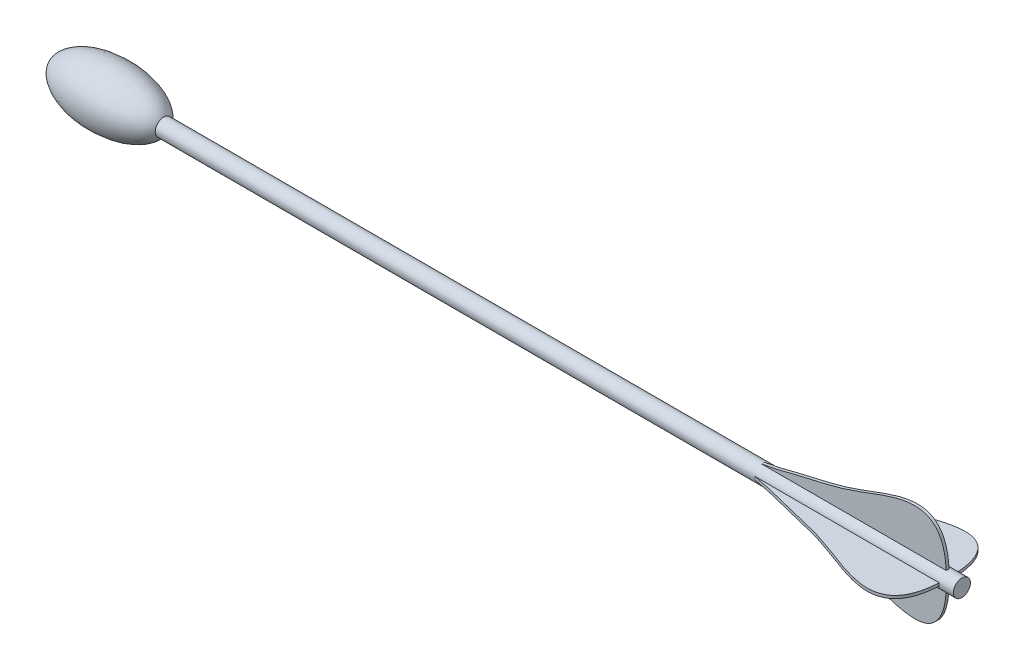
ISO-10303-21;
HEADER;
FILE_DESCRIPTION(('STEP AP214'),'2;1');
FILE_NAME('part.step','',(''),(''),'','','');
FILE_SCHEMA(('AUTOMOTIVE_DESIGN { 1 0 10303 214 1 1 1 1 }'));
ENDSEC;
DATA;
#1=APPLICATION_CONTEXT('core data for automotive mechanical design processes');
#2=APPLICATION_PROTOCOL_DEFINITION('international standard','automotive_design',2000,#1);
#3=PRODUCT_CONTEXT('',#1,'mechanical');
#4=PRODUCT('Part','Part','',(#3));
#5=PRODUCT_RELATED_PRODUCT_CATEGORY('part','',(#4));
#6=PRODUCT_DEFINITION_FORMATION('','',#4);
#7=PRODUCT_DEFINITION_CONTEXT('part definition',#1,'design');
#8=PRODUCT_DEFINITION('design','',#6,#7);
#9=PRODUCT_DEFINITION_SHAPE('','',#8);
#10=(LENGTH_UNIT() NAMED_UNIT(*) SI_UNIT(.MILLI.,.METRE.));
#11=(NAMED_UNIT(*) PLANE_ANGLE_UNIT() SI_UNIT($,.RADIAN.));
#12=(NAMED_UNIT(*) SI_UNIT($,.STERADIAN.) SOLID_ANGLE_UNIT());
#13=UNCERTAINTY_MEASURE_WITH_UNIT(LENGTH_MEASURE(1.E-05),#10,'distance_accuracy_value','');
#14=(GEOMETRIC_REPRESENTATION_CONTEXT(3) GLOBAL_UNCERTAINTY_ASSIGNED_CONTEXT((#13)) GLOBAL_UNIT_ASSIGNED_CONTEXT((#10,
#11,#12)) REPRESENTATION_CONTEXT('',''));
#15=CARTESIAN_POINT('',(0.,0.,0.));
#16=DIRECTION('',(0.,0.,1.));
#17=DIRECTION('',(1.,0.,0.));
#18=AXIS2_PLACEMENT_3D('',#15,#16,#17);
#19=CARTESIAN_POINT('',(590.,6.00000000000001,-0.999999999999979));
#20=CARTESIAN_POINT('',(585.929324234077,77.9307893094326,-0.999999999999728));
#21=CARTESIAN_POINT('',(513.784202435339,-0.952711564096372,-1.));
#22=CARTESIAN_POINT('',(520.965779305184,22.6473985539355,-0.999999999999921));
#23=CARTESIAN_POINT('',(489.80811324235,15.3745600280329,-0.999999999999946));
#24=CARTESIAN_POINT('',(487.391941510258,10.4812503897079,-0.999999999999963));
#25=CARTESIAN_POINT('',(460.,6.,-0.999999999999979));
#26=B_SPLINE_CURVE_WITH_KNOTS('',6,(#19,#20,#21,#22,#23,#24,#25),.UNSPECIFIED.,.F.,.F.,(7,7),
(0.,1.),.UNSPECIFIED.);
#27=DIRECTION('',(0.,0.,1.));
#28=VECTOR('',#27,1.);
#29=SURFACE_OF_LINEAR_EXTRUSION('',#26,#28);
#30=DIRECTION('',(0.,0.,1.));
#31=VECTOR('',#30,1.);
#32=CARTESIAN_POINT('',(460.,6.,-0.999999999999979));
#33=LINE('',#32,#31);
#34=CARTESIAN_POINT('',(460.,6.,-0.999999999999979));
#35=VERTEX_POINT('',#34);
#36=CARTESIAN_POINT('',(460.,6.,1.00000000000002));
#37=VERTEX_POINT('',#36);
#38=EDGE_CURVE('E47',#35,#37,#33,.T.);
#39=ORIENTED_EDGE('',*,*,#38,.T.);
#40=CARTESIAN_POINT('',(590.,6.,1.00000000000002));
#41=CARTESIAN_POINT('',(585.929324234077,77.9307893094326,1.00000000000027));
#42=CARTESIAN_POINT('',(513.784202435339,-0.952711564096379,0.999999999999997));
#43=CARTESIAN_POINT('',(520.965779305184,22.6473985539354,1.00000000000008));
#44=CARTESIAN_POINT('',(489.80811324235,15.3745600280329,1.00000000000005));
#45=CARTESIAN_POINT('',(487.391941510258,10.4812503897079,1.00000000000004));
#46=CARTESIAN_POINT('',(460.,6.,1.00000000000002));
#47=B_SPLINE_CURVE_WITH_KNOTS('',6,(#40,#41,#42,#43,#44,#45,#46),.UNSPECIFIED.,.F.,.F.,(7,7),
(0.,1.),.UNSPECIFIED.);
#48=CARTESIAN_POINT('',(590.,6.,1.00000000000002));
#49=VERTEX_POINT('',#48);
#50=EDGE_CURVE('E68',#49,#37,#47,.T.);
#51=ORIENTED_EDGE('',*,*,#50,.F.);
#52=DIRECTION('',(0.,0.,1.));
#53=VECTOR('',#52,1.);
#54=CARTESIAN_POINT('',(590.,6.00000000000001,-0.999999999999979));
#55=LINE('',#54,#53);
#56=CARTESIAN_POINT('',(590.,6.00000000000001,-0.999999999999979));
#57=VERTEX_POINT('',#56);
#58=EDGE_CURVE('E12',#57,#49,#55,.T.);
#59=ORIENTED_EDGE('',*,*,#58,.F.);
#60=EDGE_CURVE('E69',#57,#35,#26,.T.);
#61=ORIENTED_EDGE('',*,*,#60,.T.);
#62=EDGE_LOOP('',(#39,#51,#59,#61));
#63=FACE_BOUND('',#62,.T.);
#64=ADVANCED_FACE('F43',(#63),#29,.T.);
#65=CARTESIAN_POINT('',(460.,6.,-0.999999999999979));
#66=DIRECTION('',(0.,-1.,0.));
#67=DIRECTION('',(1.,0.,0.));
#68=AXIS2_PLACEMENT_3D('',#65,#66,#67);
#69=PLANE('',#68);
#70=ORIENTED_EDGE('',*,*,#58,.T.);
#71=DIRECTION('',(1.,0.,0.));
#72=VECTOR('',#71,1.);
#73=CARTESIAN_POINT('',(460.,6.,1.00000000000002));
#74=LINE('',#73,#72);
#75=EDGE_CURVE('E73',#37,#49,#74,.T.);
#76=ORIENTED_EDGE('',*,*,#75,.F.);
#77=ORIENTED_EDGE('',*,*,#38,.F.);
#78=DIRECTION('',(1.,0.,0.));
#79=VECTOR('',#78,1.);
#80=CARTESIAN_POINT('',(460.,6.,-0.999999999999979));
#81=LINE('',#80,#79);
#82=EDGE_CURVE('E71',#35,#57,#81,.T.);
#83=ORIENTED_EDGE('',*,*,#82,.T.);
#84=EDGE_LOOP('',(#70,#76,#77,#83));
#85=FACE_BOUND('',#84,.T.);
#86=ADVANCED_FACE('F74',(#85),#69,.T.);
#87=CARTESIAN_POINT('',(515.048873683359,18.9335615036344,-0.999999999999934));
#88=DIRECTION('',(0.,0.,-1.));
#89=DIRECTION('',(0.,1.,0.));
#90=AXIS2_PLACEMENT_3D('',#87,#88,#89);
#91=PLANE('',#90);
#92=ORIENTED_EDGE('',*,*,#60,.F.);
#93=ORIENTED_EDGE('',*,*,#82,.F.);
#94=EDGE_LOOP('',(#92,#93));
#95=FACE_BOUND('',#94,.T.);
#96=ADVANCED_FACE('F92',(#95),#91,.T.);
#97=CARTESIAN_POINT('',(515.048873683359,18.9335615036344,1.00000000000007));
#98=DIRECTION('',(0.,0.,-1.));
#99=DIRECTION('',(0.,1.,0.));
#100=AXIS2_PLACEMENT_3D('',#97,#98,#99);
#101=PLANE('',#100);
#102=ORIENTED_EDGE('',*,*,#50,.T.);
#103=ORIENTED_EDGE('',*,*,#75,.T.);
#104=EDGE_LOOP('',(#102,#103));
#105=FACE_BOUND('',#104,.T.);
#106=ADVANCED_FACE('F77',(#105),#101,.F.);
#107=CLOSED_SHELL('',(#64,#86,#96,#106));
#108=MANIFOLD_SOLID_BREP('B2',#107);
#109=CARTESIAN_POINT('',(590.,-6.,1.00000000000002));
#110=CARTESIAN_POINT('',(585.929324234077,-77.9307893094326,1.00000000000027));
#111=CARTESIAN_POINT('',(513.784202435339,0.952711564096379,0.999999999999997));
#112=CARTESIAN_POINT('',(520.965779305184,-22.6473985539354,1.00000000000008));
#113=CARTESIAN_POINT('',(489.80811324235,-15.3745600280329,1.00000000000005));
#114=CARTESIAN_POINT('',(487.391941510258,-10.4812503897079,1.00000000000004));
#115=CARTESIAN_POINT('',(460.,-6.,1.00000000000002));
#116=B_SPLINE_CURVE_WITH_KNOTS('',6,(#109,#110,#111,#112,#113,#114,#115),.UNSPECIFIED.,.F.,.F.,
(7,7),(0.,1.),.UNSPECIFIED.);
#117=DIRECTION('',(0.,0.,-1.));
#118=VECTOR('',#117,1.);
#119=SURFACE_OF_LINEAR_EXTRUSION('',#116,#118);
#120=DIRECTION('',(0.,0.,-1.));
#121=VECTOR('',#120,1.);
#122=CARTESIAN_POINT('',(460.,-6.,1.00000000000002));
#123=LINE('',#122,#121);
#124=CARTESIAN_POINT('',(460.,-6.,1.00000000000002));
#125=VERTEX_POINT('',#124);
#126=CARTESIAN_POINT('',(460.,-6.,-0.999999999999979));
#127=VERTEX_POINT('',#126);
#128=EDGE_CURVE('E139',#125,#127,#123,.T.);
#129=ORIENTED_EDGE('',*,*,#128,.T.);
#130=CARTESIAN_POINT('',(590.,-6.00000000000001,-0.999999999999979));
#131=CARTESIAN_POINT('',(585.929324234077,-77.9307893094326,-0.999999999999728));
#132=CARTESIAN_POINT('',(513.784202435339,0.952711564096372,-1.));
#133=CARTESIAN_POINT('',(520.965779305184,-22.6473985539355,-0.999999999999921));
#134=CARTESIAN_POINT('',(489.80811324235,-15.3745600280329,-0.999999999999946));
#135=CARTESIAN_POINT('',(487.391941510258,-10.4812503897079,-0.999999999999963));
#136=CARTESIAN_POINT('',(460.,-6.,-0.999999999999979));
#137=B_SPLINE_CURVE_WITH_KNOTS('',6,(#130,#131,#132,#133,#134,#135,#136),.UNSPECIFIED.,.F.,.F.,
(7,7),(0.,1.),.UNSPECIFIED.);
#138=CARTESIAN_POINT('',(590.,-6.00000000000001,-0.999999999999979));
#139=VERTEX_POINT('',#138);
#140=EDGE_CURVE('E160',#139,#127,#137,.T.);
#141=ORIENTED_EDGE('',*,*,#140,.F.);
#142=DIRECTION('',(0.,0.,-1.));
#143=VECTOR('',#142,1.);
#144=CARTESIAN_POINT('',(590.,-6.,1.00000000000002));
#145=LINE('',#144,#143);
#146=CARTESIAN_POINT('',(590.,-6.,1.00000000000002));
#147=VERTEX_POINT('',#146);
#148=EDGE_CURVE('E41',#147,#139,#145,.T.);
#149=ORIENTED_EDGE('',*,*,#148,.F.);
#150=EDGE_CURVE('E161',#147,#125,#116,.T.);
#151=ORIENTED_EDGE('',*,*,#150,.T.);
#152=EDGE_LOOP('',(#129,#141,#149,#151));
#153=FACE_BOUND('',#152,.T.);
#154=ADVANCED_FACE('F135',(#153),#119,.T.);
#155=CARTESIAN_POINT('',(460.,-6.,1.00000000000002));
#156=DIRECTION('',(0.,1.,0.));
#157=DIRECTION('',(1.,0.,0.));
#158=AXIS2_PLACEMENT_3D('',#155,#156,#157);
#159=PLANE('',#158);
#160=ORIENTED_EDGE('',*,*,#148,.T.);
#161=DIRECTION('',(1.,0.,0.));
#162=VECTOR('',#161,1.);
#163=CARTESIAN_POINT('',(460.,-6.,-0.999999999999979));
#164=LINE('',#163,#162);
#165=EDGE_CURVE('E165',#127,#139,#164,.T.);
#166=ORIENTED_EDGE('',*,*,#165,.F.);
#167=ORIENTED_EDGE('',*,*,#128,.F.);
#168=DIRECTION('',(1.,0.,0.));
#169=VECTOR('',#168,1.);
#170=CARTESIAN_POINT('',(460.,-6.,1.00000000000002));
#171=LINE('',#170,#169);
#172=EDGE_CURVE('E163',#125,#147,#171,.T.);
#173=ORIENTED_EDGE('',*,*,#172,.T.);
#174=EDGE_LOOP('',(#160,#166,#167,#173));
#175=FACE_BOUND('',#174,.T.);
#176=ADVANCED_FACE('F166',(#175),#159,.T.);
#177=CARTESIAN_POINT('',(515.048873683359,-18.9335615036344,1.00000000000007));
#178=DIRECTION('',(0.,0.,1.));
#179=DIRECTION('',(0.,-1.,0.));
#180=AXIS2_PLACEMENT_3D('',#177,#178,#179);
#181=PLANE('',#180);
#182=ORIENTED_EDGE('',*,*,#150,.F.);
#183=ORIENTED_EDGE('',*,*,#172,.F.);
#184=EDGE_LOOP('',(#182,#183));
#185=FACE_BOUND('',#184,.T.);
#186=ADVANCED_FACE('F184',(#185),#181,.T.);
#187=CARTESIAN_POINT('',(515.048873683359,-18.9335615036344,-0.999999999999934));
#188=DIRECTION('',(0.,0.,1.));
#189=DIRECTION('',(0.,-1.,0.));
#190=AXIS2_PLACEMENT_3D('',#187,#188,#189);
#191=PLANE('',#190);
#192=ORIENTED_EDGE('',*,*,#140,.T.);
#193=ORIENTED_EDGE('',*,*,#165,.T.);
#194=EDGE_LOOP('',(#192,#193));
#195=FACE_BOUND('',#194,.T.);
#196=ADVANCED_FACE('F169',(#195),#191,.F.);
#197=CLOSED_SHELL('',(#154,#176,#186,#196));
#198=MANIFOLD_SOLID_BREP('B6',#197);
#199=CARTESIAN_POINT('',(460.,-1.,6.));
#200=CARTESIAN_POINT('',(487.391941510258,-1.,10.4812503897079));
#201=CARTESIAN_POINT('',(489.80811324235,-1.,15.3745600280329));
#202=CARTESIAN_POINT('',(520.965779305184,-1.,22.6473985539355));
#203=CARTESIAN_POINT('',(513.784202435339,-1.,-0.952711564096376));
#204=CARTESIAN_POINT('',(585.929324234077,-1.,77.9307893094326));
#205=CARTESIAN_POINT('',(590.,-1.,6.));
#206=B_SPLINE_CURVE_WITH_KNOTS('',6,(#199,#200,#201,#202,#203,#204,#205),.UNSPECIFIED.,.F.,.F.,
(7,7),(0.,1.),.UNSPECIFIED.);
#207=DIRECTION('',(0.,1.,0.));
#208=VECTOR('',#207,1.);
#209=SURFACE_OF_LINEAR_EXTRUSION('',#206,#208);
#210=DIRECTION('',(0.,1.,0.));
#211=VECTOR('',#210,1.);
#212=CARTESIAN_POINT('',(590.,-1.,6.));
#213=LINE('',#212,#211);
#214=CARTESIAN_POINT('',(590.,-1.,6.));
#215=VERTEX_POINT('',#214);
#216=CARTESIAN_POINT('',(590.,1.,6.));
#217=VERTEX_POINT('',#216);
#218=EDGE_CURVE('E231',#215,#217,#213,.T.);
#219=ORIENTED_EDGE('',*,*,#218,.T.);
#220=CARTESIAN_POINT('',(460.,1.,6.));
#221=CARTESIAN_POINT('',(487.391941510258,1.,10.4812503897079));
#222=CARTESIAN_POINT('',(489.80811324235,1.,15.3745600280329));
#223=CARTESIAN_POINT('',(520.965779305184,1.,22.6473985539355));
#224=CARTESIAN_POINT('',(513.784202435339,1.,-0.952711564096376));
#225=CARTESIAN_POINT('',(585.929324234077,1.,77.9307893094326));
#226=CARTESIAN_POINT('',(590.,1.,6.));
#227=B_SPLINE_CURVE_WITH_KNOTS('',6,(#220,#221,#222,#223,#224,#225,#226),.UNSPECIFIED.,.F.,.F.,
(7,7),(0.,1.),.UNSPECIFIED.);
#228=CARTESIAN_POINT('',(460.,1.,6.));
#229=VERTEX_POINT('',#228);
#230=EDGE_CURVE('E252',#229,#217,#227,.T.);
#231=ORIENTED_EDGE('',*,*,#230,.F.);
#232=DIRECTION('',(0.,1.,0.));
#233=VECTOR('',#232,1.);
#234=CARTESIAN_POINT('',(460.,-1.,6.));
#235=LINE('',#234,#233);
#236=CARTESIAN_POINT('',(460.,-1.,6.));
#237=VERTEX_POINT('',#236);
#238=EDGE_CURVE('E133',#237,#229,#235,.T.);
#239=ORIENTED_EDGE('',*,*,#238,.F.);
#240=EDGE_CURVE('E253',#237,#215,#206,.T.);
#241=ORIENTED_EDGE('',*,*,#240,.T.);
#242=EDGE_LOOP('',(#219,#231,#239,#241));
#243=FACE_BOUND('',#242,.T.);
#244=ADVANCED_FACE('F227',(#243),#209,.T.);
#245=CARTESIAN_POINT('',(460.,-1.,6.));
#246=DIRECTION('',(0.,0.,-1.));
#247=DIRECTION('',(-1.,0.,0.));
#248=AXIS2_PLACEMENT_3D('',#245,#246,#247);
#249=PLANE('',#248);
#250=ORIENTED_EDGE('',*,*,#238,.T.);
#251=DIRECTION('',(-1.,0.,0.));
#252=VECTOR('',#251,1.);
#253=CARTESIAN_POINT('',(460.,1.,6.));
#254=LINE('',#253,#252);
#255=EDGE_CURVE('E257',#217,#229,#254,.T.);
#256=ORIENTED_EDGE('',*,*,#255,.F.);
#257=ORIENTED_EDGE('',*,*,#218,.F.);
#258=DIRECTION('',(-1.,0.,0.));
#259=VECTOR('',#258,1.);
#260=CARTESIAN_POINT('',(460.,-1.,6.));
#261=LINE('',#260,#259);
#262=EDGE_CURVE('E255',#215,#237,#261,.T.);
#263=ORIENTED_EDGE('',*,*,#262,.T.);
#264=EDGE_LOOP('',(#250,#256,#257,#263));
#265=FACE_BOUND('',#264,.T.);
#266=ADVANCED_FACE('F258',(#265),#249,.T.);
#267=CARTESIAN_POINT('',(515.048873683359,-1.,18.9335615036344));
#268=DIRECTION('',(0.,1.,0.));
#269=DIRECTION('',(0.,0.,1.));
#270=AXIS2_PLACEMENT_3D('',#267,#268,#269);
#271=PLANE('',#270);
#272=ORIENTED_EDGE('',*,*,#240,.F.);
#273=ORIENTED_EDGE('',*,*,#262,.F.);
#274=EDGE_LOOP('',(#272,#273));
#275=FACE_BOUND('',#274,.T.);
#276=ADVANCED_FACE('F276',(#275),#271,.F.);
#277=CARTESIAN_POINT('',(515.048873683359,1.,18.9335615036344));
#278=DIRECTION('',(0.,1.,0.));
#279=DIRECTION('',(0.,0.,1.));
#280=AXIS2_PLACEMENT_3D('',#277,#278,#279);
#281=PLANE('',#280);
#282=ORIENTED_EDGE('',*,*,#230,.T.);
#283=ORIENTED_EDGE('',*,*,#255,.T.);
#284=EDGE_LOOP('',(#282,#283));
#285=FACE_BOUND('',#284,.T.);
#286=ADVANCED_FACE('F261',(#285),#281,.T.);
#287=CLOSED_SHELL('',(#244,#266,#276,#286));
#288=MANIFOLD_SOLID_BREP('B35',#287);
#289=CARTESIAN_POINT('',(590.,-1.,-6.));
#290=CARTESIAN_POINT('',(585.929324234077,-1.,-77.9307893094326));
#291=CARTESIAN_POINT('',(513.784202435339,-1.,0.952711564096376));
#292=CARTESIAN_POINT('',(520.965779305184,-1.,-22.6473985539355));
#293=CARTESIAN_POINT('',(489.80811324235,-1.,-15.3745600280329));
#294=CARTESIAN_POINT('',(487.391941510258,-1.,-10.4812503897079));
#295=CARTESIAN_POINT('',(460.,-1.,-6.));
#296=B_SPLINE_CURVE_WITH_KNOTS('',6,(#289,#290,#291,#292,#293,#294,#295),.UNSPECIFIED.,.F.,.F.,
(7,7),(0.,1.),.UNSPECIFIED.);
#297=DIRECTION('',(0.,1.,0.));
#298=VECTOR('',#297,1.);
#299=SURFACE_OF_LINEAR_EXTRUSION('',#296,#298);
#300=DIRECTION('',(0.,1.,0.));
#301=VECTOR('',#300,1.);
#302=CARTESIAN_POINT('',(460.,-1.,-6.));
#303=LINE('',#302,#301);
#304=CARTESIAN_POINT('',(460.,-1.,-6.));
#305=VERTEX_POINT('',#304);
#306=CARTESIAN_POINT('',(460.,1.,-6.));
#307=VERTEX_POINT('',#306);
#308=EDGE_CURVE('E322',#305,#307,#303,.T.);
#309=ORIENTED_EDGE('',*,*,#308,.T.);
#310=CARTESIAN_POINT('',(590.,1.,-6.));
#311=CARTESIAN_POINT('',(585.929324234077,1.,-77.9307893094326));
#312=CARTESIAN_POINT('',(513.784202435339,1.,0.952711564096376));
#313=CARTESIAN_POINT('',(520.965779305184,1.,-22.6473985539355));
#314=CARTESIAN_POINT('',(489.80811324235,1.,-15.3745600280329));
#315=CARTESIAN_POINT('',(487.391941510258,1.,-10.4812503897079));
#316=CARTESIAN_POINT('',(460.,1.,-6.));
#317=B_SPLINE_CURVE_WITH_KNOTS('',6,(#310,#311,#312,#313,#314,#315,#316),.UNSPECIFIED.,.F.,.F.,
(7,7),(0.,1.),.UNSPECIFIED.);
#318=CARTESIAN_POINT('',(590.,1.,-6.));
#319=VERTEX_POINT('',#318);
#320=EDGE_CURVE('E343',#319,#307,#317,.T.);
#321=ORIENTED_EDGE('',*,*,#320,.F.);
#322=DIRECTION('',(0.,1.,0.));
#323=VECTOR('',#322,1.);
#324=CARTESIAN_POINT('',(590.,-1.,-6.));
#325=LINE('',#324,#323);
#326=CARTESIAN_POINT('',(590.,-1.,-6.));
#327=VERTEX_POINT('',#326);
#328=EDGE_CURVE('E225',#327,#319,#325,.T.);
#329=ORIENTED_EDGE('',*,*,#328,.F.);
#330=EDGE_CURVE('E344',#327,#305,#296,.T.);
#331=ORIENTED_EDGE('',*,*,#330,.T.);
#332=EDGE_LOOP('',(#309,#321,#329,#331));
#333=FACE_BOUND('',#332,.T.);
#334=ADVANCED_FACE('F318',(#333),#299,.T.);
#335=CARTESIAN_POINT('',(460.,-1.,-6.));
#336=DIRECTION('',(0.,0.,1.));
#337=DIRECTION('',(1.,0.,0.));
#338=AXIS2_PLACEMENT_3D('',#335,#336,#337);
#339=PLANE('',#338);
#340=ORIENTED_EDGE('',*,*,#328,.T.);
#341=DIRECTION('',(1.,0.,0.));
#342=VECTOR('',#341,1.);
#343=CARTESIAN_POINT('',(460.,1.,-6.));
#344=LINE('',#343,#342);
#345=EDGE_CURVE('E348',#307,#319,#344,.T.);
#346=ORIENTED_EDGE('',*,*,#345,.F.);
#347=ORIENTED_EDGE('',*,*,#308,.F.);
#348=DIRECTION('',(1.,0.,0.));
#349=VECTOR('',#348,1.);
#350=CARTESIAN_POINT('',(460.,-1.,-6.));
#351=LINE('',#350,#349);
#352=EDGE_CURVE('E346',#305,#327,#351,.T.);
#353=ORIENTED_EDGE('',*,*,#352,.T.);
#354=EDGE_LOOP('',(#340,#346,#347,#353));
#355=FACE_BOUND('',#354,.T.);
#356=ADVANCED_FACE('F349',(#355),#339,.T.);
#357=CARTESIAN_POINT('',(515.048873683359,-1.,-18.9335615036344));
#358=DIRECTION('',(0.,-1.,0.));
#359=DIRECTION('',(0.,0.,-1.));
#360=AXIS2_PLACEMENT_3D('',#357,#358,#359);
#361=PLANE('',#360);
#362=ORIENTED_EDGE('',*,*,#330,.F.);
#363=ORIENTED_EDGE('',*,*,#352,.F.);
#364=EDGE_LOOP('',(#362,#363));
#365=FACE_BOUND('',#364,.T.);
#366=ADVANCED_FACE('F367',(#365),#361,.T.);
#367=CARTESIAN_POINT('',(515.048873683359,1.,-18.9335615036344));
#368=DIRECTION('',(0.,-1.,0.));
#369=DIRECTION('',(0.,0.,-1.));
#370=AXIS2_PLACEMENT_3D('',#367,#368,#369);
#371=PLANE('',#370);
#372=ORIENTED_EDGE('',*,*,#320,.T.);
#373=ORIENTED_EDGE('',*,*,#345,.T.);
#374=EDGE_LOOP('',(#372,#373));
#375=FACE_BOUND('',#374,.T.);
#376=ADVANCED_FACE('F352',(#375),#371,.F.);
#377=CLOSED_SHELL('',(#334,#356,#366,#376));
#378=MANIFOLD_SOLID_BREP('B127',#377);
#379=CARTESIAN_POINT('',(0.,0.,0.));
#380=DIRECTION('',(0.,1.,0.));
#381=DIRECTION('',(1.,0.,0.));
#382=AXIS2_PLACEMENT_3D('',#379,#380,#381);
#383=ELLIPSE('',#382,40.,20.);
#384=TRIMMED_CURVE('',#383,(PARAMETER_VALUE(3.14159265358979)),
(PARAMETER_VALUE(6.28318530717959)),.T.,.PARAMETER.);
#385=CARTESIAN_POINT('',(-40.,0.,0.));
#386=DIRECTION('',(-1.,0.,0.));
#387=AXIS1_PLACEMENT('',#385,#386);
#388=SURFACE_OF_REVOLUTION('',#384,#387);
#389=CARTESIAN_POINT('',(38.1575680566778,0.,0.));
#390=DIRECTION('',(-1.,0.,0.));
#391=DIRECTION('',(0.,0.,1.));
#392=AXIS2_PLACEMENT_3D('',#389,#390,#391);
#393=CIRCLE('',#392,6.);
#394=CARTESIAN_POINT('',(38.1575680566778,0.,6.));
#395=VERTEX_POINT('',#394);
#396=EDGE_CURVE('E316',#395,#395,#393,.F.);
#397=ORIENTED_EDGE('',*,*,#396,.F.);
#398=EDGE_LOOP('',(#397));
#399=FACE_BOUND('',#398,.T.);
#400=CARTESIAN_POINT('',(-40.,0.,0.));
#401=VERTEX_POINT('',#400);
#402=VERTEX_LOOP('',#401);
#403=FACE_BOUND('',#402,.T.);
#404=ADVANCED_FACE('F400',(#399,#403),#388,.F.);
#405=CARTESIAN_POINT('',(-40.002,0.,0.));
#406=DIRECTION('',(1.,0.,0.));
#407=DIRECTION('',(0.,0.,-1.));
#408=AXIS2_PLACEMENT_3D('',#405,#406,#407);
#409=CYLINDRICAL_SURFACE('',#408,6.);
#410=ORIENTED_EDGE('',*,*,#396,.T.);
#411=EDGE_LOOP('',(#410));
#412=FACE_BOUND('',#411,.T.);
#413=CARTESIAN_POINT('',(600.,0.,0.));
#414=DIRECTION('',(1.,0.,0.));
#415=DIRECTION('',(0.,0.,-1.));
#416=AXIS2_PLACEMENT_3D('',#413,#414,#415);
#417=CIRCLE('',#416,6.);
#418=CARTESIAN_POINT('',(600.,0.,-6.));
#419=VERTEX_POINT('',#418);
#420=EDGE_CURVE('E406',#419,#419,#417,.T.);
#421=ORIENTED_EDGE('',*,*,#420,.F.);
#422=EDGE_LOOP('',(#421));
#423=FACE_BOUND('',#422,.T.);
#424=ADVANCED_FACE('F410',(#412,#423),#409,.T.);
#425=CARTESIAN_POINT('',(600.,0.,0.));
#426=DIRECTION('',(1.,0.,0.));
#427=DIRECTION('',(0.,0.,-1.));
#428=AXIS2_PLACEMENT_3D('',#425,#426,#427);
#429=PLANE('',#428);
#430=ORIENTED_EDGE('',*,*,#420,.T.);
#431=EDGE_LOOP('',(#430));
#432=FACE_BOUND('',#431,.T.);
#433=ADVANCED_FACE('F412',(#432),#429,.T.);
#434=CLOSED_SHELL('',(#404,#424,#433));
#435=MANIFOLD_SOLID_BREP('B219',#434);
#436=ADVANCED_BREP_SHAPE_REPRESENTATION('',(#18,#108,#198,#288,#378,#435),#14);
#437=SHAPE_DEFINITION_REPRESENTATION(#9,#436);
ENDSEC;
END-ISO-10303-21;
